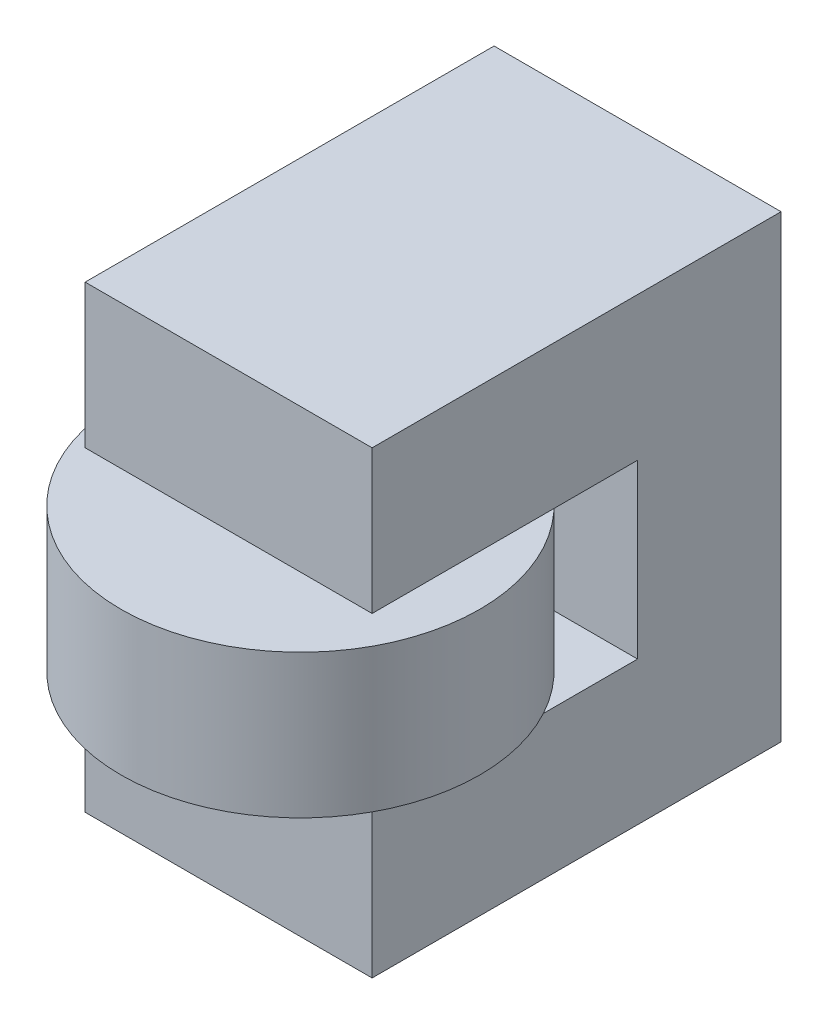
ISO-10303-21;
HEADER;
FILE_DESCRIPTION(('STEP AP214'),'2;1');
FILE_NAME('part.step','',(''),(''),'','','');
FILE_SCHEMA(('AUTOMOTIVE_DESIGN { 1 0 10303 214 1 1 1 1 }'));
ENDSEC;
DATA;
#1=APPLICATION_CONTEXT('core data for automotive mechanical design processes');
#2=APPLICATION_PROTOCOL_DEFINITION('international standard','automotive_design',2000,#1);
#3=PRODUCT_CONTEXT('',#1,'mechanical');
#4=PRODUCT('Part','Part','',(#3));
#5=PRODUCT_RELATED_PRODUCT_CATEGORY('part','',(#4));
#6=PRODUCT_DEFINITION_FORMATION('','',#4);
#7=PRODUCT_DEFINITION_CONTEXT('part definition',#1,'design');
#8=PRODUCT_DEFINITION('design','',#6,#7);
#9=PRODUCT_DEFINITION_SHAPE('','',#8);
#10=(LENGTH_UNIT() NAMED_UNIT(*) SI_UNIT(.MILLI.,.METRE.));
#11=(NAMED_UNIT(*) PLANE_ANGLE_UNIT() SI_UNIT($,.RADIAN.));
#12=(NAMED_UNIT(*) SI_UNIT($,.STERADIAN.) SOLID_ANGLE_UNIT());
#13=UNCERTAINTY_MEASURE_WITH_UNIT(LENGTH_MEASURE(1.E-05),#10,'distance_accuracy_value','');
#14=(GEOMETRIC_REPRESENTATION_CONTEXT(3) GLOBAL_UNCERTAINTY_ASSIGNED_CONTEXT((#13)) GLOBAL_UNIT_ASSIGNED_CONTEXT((#10,
#11,#12)) REPRESENTATION_CONTEXT('',''));
#15=CARTESIAN_POINT('',(0.,0.,0.));
#16=DIRECTION('',(0.,0.,1.));
#17=DIRECTION('',(1.,0.,0.));
#18=AXIS2_PLACEMENT_3D('',#15,#16,#17);
#19=CARTESIAN_POINT('',(-10.,-11.,5.));
#20=DIRECTION('',(0.,0.,1.));
#21=DIRECTION('',(0.,-1.,0.));
#22=AXIS2_PLACEMENT_3D('',#19,#20,#21);
#23=PLANE('',#22);
#24=DIRECTION('',(1.,0.,0.));
#25=VECTOR('',#24,1.);
#26=CARTESIAN_POINT('',(-10.,-11.,5.));
#27=LINE('',#26,#25);
#28=CARTESIAN_POINT('',(-10.,-11.,5.));
#29=VERTEX_POINT('',#28);
#30=CARTESIAN_POINT('',(10.,-11.,5.));
#31=VERTEX_POINT('',#30);
#32=EDGE_CURVE('E49',#29,#31,#27,.T.);
#33=ORIENTED_EDGE('',*,*,#32,.T.);
#34=DIRECTION('',(0.,-1.,0.));
#35=VECTOR('',#34,1.);
#36=CARTESIAN_POINT('',(10.,-11.,5.));
#37=LINE('',#36,#35);
#38=CARTESIAN_POINT('',(10.,-1.,5.));
#39=VERTEX_POINT('',#38);
#40=EDGE_CURVE('E112',#39,#31,#37,.T.);
#41=ORIENTED_EDGE('',*,*,#40,.F.);
#42=DIRECTION('',(1.,0.,0.));
#43=VECTOR('',#42,1.);
#44=CARTESIAN_POINT('',(-10.,-1.,5.));
#45=LINE('',#44,#43);
#46=CARTESIAN_POINT('',(-10.,-1.,5.));
#47=VERTEX_POINT('',#46);
#48=EDGE_CURVE('E12',#47,#39,#45,.T.);
#49=ORIENTED_EDGE('',*,*,#48,.F.);
#50=DIRECTION('',(0.,-1.,0.));
#51=VECTOR('',#50,1.);
#52=CARTESIAN_POINT('',(-10.,-11.,5.));
#53=LINE('',#52,#51);
#54=EDGE_CURVE('E115',#47,#29,#53,.T.);
#55=ORIENTED_EDGE('',*,*,#54,.T.);
#56=EDGE_LOOP('',(#33,#41,#49,#55));
#57=FACE_BOUND('',#56,.T.);
#58=ADVANCED_FACE('F50',(#57),#23,.T.);
#59=CARTESIAN_POINT('',(-10.,-1.,5.));
#60=DIRECTION('',(0.,1.,0.));
#61=DIRECTION('',(0.,0.,1.));
#62=AXIS2_PLACEMENT_3D('',#59,#60,#61);
#63=PLANE('',#62);
#64=ORIENTED_EDGE('',*,*,#48,.T.);
#65=DIRECTION('',(0.,0.,1.));
#66=VECTOR('',#65,1.);
#67=CARTESIAN_POINT('',(10.,-1.,5.));
#68=LINE('',#67,#66);
#69=CARTESIAN_POINT('',(10.,-1.,-13.5));
#70=VERTEX_POINT('',#69);
#71=EDGE_CURVE('E129',#70,#39,#68,.T.);
#72=ORIENTED_EDGE('',*,*,#71,.F.);
#73=DIRECTION('',(1.,0.,0.));
#74=VECTOR('',#73,1.);
#75=CARTESIAN_POINT('',(-10.,-1.,-13.5));
#76=LINE('',#75,#74);
#77=CARTESIAN_POINT('',(-10.,-1.,-13.5));
#78=VERTEX_POINT('',#77);
#79=EDGE_CURVE('E54',#78,#70,#76,.T.);
#80=ORIENTED_EDGE('',*,*,#79,.F.);
#81=DIRECTION('',(0.,0.,1.));
#82=VECTOR('',#81,1.);
#83=CARTESIAN_POINT('',(-10.,-1.,5.));
#84=LINE('',#83,#82);
#85=EDGE_CURVE('E120',#78,#47,#84,.T.);
#86=ORIENTED_EDGE('',*,*,#85,.T.);
#87=EDGE_LOOP('',(#64,#72,#80,#86));
#88=FACE_BOUND('',#87,.T.);
#89=ADVANCED_FACE('F195',(#88),#63,.T.);
#90=CARTESIAN_POINT('',(-10.,-1.,-13.5));
#91=DIRECTION('',(0.,0.,1.));
#92=DIRECTION('',(1.,0.,0.));
#93=AXIS2_PLACEMENT_3D('',#90,#91,#92);
#94=PLANE('',#93);
#95=ORIENTED_EDGE('',*,*,#79,.T.);
#96=DIRECTION('',(0.,-1.,0.));
#97=VECTOR('',#96,1.);
#98=CARTESIAN_POINT('',(10.,-1.,-13.5));
#99=LINE('',#98,#97);
#100=CARTESIAN_POINT('',(10.,11.,-13.5));
#101=VERTEX_POINT('',#100);
#102=EDGE_CURVE('E142',#101,#70,#99,.T.);
#103=ORIENTED_EDGE('',*,*,#102,.F.);
#104=DIRECTION('',(1.,0.,0.));
#105=VECTOR('',#104,1.);
#106=CARTESIAN_POINT('',(-10.,11.,-13.5));
#107=LINE('',#106,#105);
#108=CARTESIAN_POINT('',(-10.,11.,-13.5));
#109=VERTEX_POINT('',#108);
#110=EDGE_CURVE('E163',#109,#101,#107,.T.);
#111=ORIENTED_EDGE('',*,*,#110,.F.);
#112=DIRECTION('',(0.,-1.,0.));
#113=VECTOR('',#112,1.);
#114=CARTESIAN_POINT('',(-10.,-1.,-13.5));
#115=LINE('',#114,#113);
#116=EDGE_CURVE('E159',#109,#78,#115,.T.);
#117=ORIENTED_EDGE('',*,*,#116,.T.);
#118=EDGE_LOOP('',(#95,#103,#111,#117));
#119=FACE_BOUND('',#118,.T.);
#120=ADVANCED_FACE('F194',(#119),#94,.T.);
#121=CARTESIAN_POINT('',(-10.,11.,5.));
#122=DIRECTION('',(0.,-1.,0.));
#123=DIRECTION('',(0.,0.,-1.));
#124=AXIS2_PLACEMENT_3D('',#121,#122,#123);
#125=PLANE('',#124);
#126=ORIENTED_EDGE('',*,*,#110,.T.);
#127=DIRECTION('',(0.,0.,-1.));
#128=VECTOR('',#127,1.);
#129=CARTESIAN_POINT('',(10.,11.,5.));
#130=LINE('',#129,#128);
#131=CARTESIAN_POINT('',(10.,11.,5.));
#132=VERTEX_POINT('',#131);
#133=EDGE_CURVE('E136',#132,#101,#130,.T.);
#134=ORIENTED_EDGE('',*,*,#133,.F.);
#135=DIRECTION('',(1.,0.,0.));
#136=VECTOR('',#135,1.);
#137=CARTESIAN_POINT('',(-10.,11.,5.));
#138=LINE('',#137,#136);
#139=CARTESIAN_POINT('',(-10.,11.,5.));
#140=VERTEX_POINT('',#139);
#141=EDGE_CURVE('E167',#140,#132,#138,.T.);
#142=ORIENTED_EDGE('',*,*,#141,.F.);
#143=DIRECTION('',(0.,0.,-1.));
#144=VECTOR('',#143,1.);
#145=CARTESIAN_POINT('',(-10.,11.,5.));
#146=LINE('',#145,#144);
#147=EDGE_CURVE('E160',#140,#109,#146,.T.);
#148=ORIENTED_EDGE('',*,*,#147,.T.);
#149=EDGE_LOOP('',(#126,#134,#142,#148));
#150=FACE_BOUND('',#149,.T.);
#151=ADVANCED_FACE('F189',(#150),#125,.T.);
#152=CARTESIAN_POINT('',(-10.,21.,5.));
#153=DIRECTION('',(0.,0.,1.));
#154=DIRECTION('',(0.,-1.,0.));
#155=AXIS2_PLACEMENT_3D('',#152,#153,#154);
#156=PLANE('',#155);
#157=ORIENTED_EDGE('',*,*,#141,.T.);
#158=DIRECTION('',(0.,-1.,0.));
#159=VECTOR('',#158,1.);
#160=CARTESIAN_POINT('',(10.,21.,5.));
#161=LINE('',#160,#159);
#162=CARTESIAN_POINT('',(10.,21.,5.));
#163=VERTEX_POINT('',#162);
#164=EDGE_CURVE('E137',#163,#132,#161,.T.);
#165=ORIENTED_EDGE('',*,*,#164,.F.);
#166=DIRECTION('',(1.,0.,0.));
#167=VECTOR('',#166,1.);
#168=CARTESIAN_POINT('',(-10.,21.,5.));
#169=LINE('',#168,#167);
#170=CARTESIAN_POINT('',(-10.,21.,5.));
#171=VERTEX_POINT('',#170);
#172=EDGE_CURVE('E169',#171,#163,#169,.T.);
#173=ORIENTED_EDGE('',*,*,#172,.F.);
#174=DIRECTION('',(0.,-1.,0.));
#175=VECTOR('',#174,1.);
#176=CARTESIAN_POINT('',(-10.,21.,5.));
#177=LINE('',#176,#175);
#178=EDGE_CURVE('E152',#171,#140,#177,.T.);
#179=ORIENTED_EDGE('',*,*,#178,.T.);
#180=EDGE_LOOP('',(#157,#165,#173,#179));
#181=FACE_BOUND('',#180,.T.);
#182=ADVANCED_FACE('F182',(#181),#156,.T.);
#183=CARTESIAN_POINT('',(-10.,21.,-23.5));
#184=DIRECTION('',(0.,1.,0.));
#185=DIRECTION('',(0.,0.,1.));
#186=AXIS2_PLACEMENT_3D('',#183,#184,#185);
#187=PLANE('',#186);
#188=ORIENTED_EDGE('',*,*,#172,.T.);
#189=DIRECTION('',(0.,0.,1.));
#190=VECTOR('',#189,1.);
#191=CARTESIAN_POINT('',(10.,21.,-23.5));
#192=LINE('',#191,#190);
#193=CARTESIAN_POINT('',(10.,21.,-23.5));
#194=VERTEX_POINT('',#193);
#195=EDGE_CURVE('E134',#194,#163,#192,.T.);
#196=ORIENTED_EDGE('',*,*,#195,.F.);
#197=DIRECTION('',(1.,0.,0.));
#198=VECTOR('',#197,1.);
#199=CARTESIAN_POINT('',(-10.,21.,-23.5));
#200=LINE('',#199,#198);
#201=CARTESIAN_POINT('',(-10.,21.,-23.5));
#202=VERTEX_POINT('',#201);
#203=EDGE_CURVE('E168',#202,#194,#200,.T.);
#204=ORIENTED_EDGE('',*,*,#203,.F.);
#205=DIRECTION('',(0.,0.,1.));
#206=VECTOR('',#205,1.);
#207=CARTESIAN_POINT('',(-10.,21.,-23.5));
#208=LINE('',#207,#206);
#209=EDGE_CURVE('E151',#202,#171,#208,.T.);
#210=ORIENTED_EDGE('',*,*,#209,.T.);
#211=EDGE_LOOP('',(#188,#196,#204,#210));
#212=FACE_BOUND('',#211,.T.);
#213=ADVANCED_FACE('F180',(#212),#187,.T.);
#214=CARTESIAN_POINT('',(-10.,21.,-23.5));
#215=DIRECTION('',(0.,0.,-1.));
#216=DIRECTION('',(-1.,0.,0.));
#217=AXIS2_PLACEMENT_3D('',#214,#215,#216);
#218=PLANE('',#217);
#219=ORIENTED_EDGE('',*,*,#203,.T.);
#220=DIRECTION('',(0.,1.,0.));
#221=VECTOR('',#220,1.);
#222=CARTESIAN_POINT('',(10.,21.,-23.5));
#223=LINE('',#222,#221);
#224=CARTESIAN_POINT('',(10.,-11.,-23.5));
#225=VERTEX_POINT('',#224);
#226=EDGE_CURVE('E121',#225,#194,#223,.T.);
#227=ORIENTED_EDGE('',*,*,#226,.F.);
#228=DIRECTION('',(1.,0.,0.));
#229=VECTOR('',#228,1.);
#230=CARTESIAN_POINT('',(-10.,-11.,-23.5));
#231=LINE('',#230,#229);
#232=CARTESIAN_POINT('',(-10.,-11.,-23.5));
#233=VERTEX_POINT('',#232);
#234=EDGE_CURVE('E117',#233,#225,#231,.T.);
#235=ORIENTED_EDGE('',*,*,#234,.F.);
#236=DIRECTION('',(0.,1.,0.));
#237=VECTOR('',#236,1.);
#238=CARTESIAN_POINT('',(-10.,21.,-23.5));
#239=LINE('',#238,#237);
#240=EDGE_CURVE('E146',#233,#202,#239,.T.);
#241=ORIENTED_EDGE('',*,*,#240,.T.);
#242=EDGE_LOOP('',(#219,#227,#235,#241));
#243=FACE_BOUND('',#242,.T.);
#244=ADVANCED_FACE('F175',(#243),#218,.T.);
#245=CARTESIAN_POINT('',(-10.,-11.,-23.5));
#246=DIRECTION('',(0.,-1.,0.));
#247=DIRECTION('',(0.,0.,-1.));
#248=AXIS2_PLACEMENT_3D('',#245,#246,#247);
#249=PLANE('',#248);
#250=ORIENTED_EDGE('',*,*,#234,.T.);
#251=DIRECTION('',(0.,0.,-1.));
#252=VECTOR('',#251,1.);
#253=CARTESIAN_POINT('',(10.,-11.,-23.5));
#254=LINE('',#253,#252);
#255=EDGE_CURVE('E116',#31,#225,#254,.T.);
#256=ORIENTED_EDGE('',*,*,#255,.F.);
#257=ORIENTED_EDGE('',*,*,#32,.F.);
#258=DIRECTION('',(0.,0.,-1.));
#259=VECTOR('',#258,1.);
#260=CARTESIAN_POINT('',(-10.,-11.,-23.5));
#261=LINE('',#260,#259);
#262=EDGE_CURVE('E148',#29,#233,#261,.T.);
#263=ORIENTED_EDGE('',*,*,#262,.T.);
#264=EDGE_LOOP('',(#250,#256,#257,#263));
#265=FACE_BOUND('',#264,.T.);
#266=ADVANCED_FACE('F118',(#265),#249,.T.);
#267=CARTESIAN_POINT('',(-10.,0.,0.));
#268=DIRECTION('',(-1.,0.,0.));
#269=DIRECTION('',(0.,0.,1.));
#270=AXIS2_PLACEMENT_3D('',#267,#268,#269);
#271=PLANE('',#270);
#272=ORIENTED_EDGE('',*,*,#54,.F.);
#273=ORIENTED_EDGE('',*,*,#85,.F.);
#274=ORIENTED_EDGE('',*,*,#116,.F.);
#275=ORIENTED_EDGE('',*,*,#147,.F.);
#276=ORIENTED_EDGE('',*,*,#178,.F.);
#277=ORIENTED_EDGE('',*,*,#209,.F.);
#278=ORIENTED_EDGE('',*,*,#240,.F.);
#279=ORIENTED_EDGE('',*,*,#262,.F.);
#280=EDGE_LOOP('',(#272,#273,#274,#275,#276,#277,#278,#279));
#281=FACE_BOUND('',#280,.T.);
#282=ADVANCED_FACE('F184',(#281),#271,.T.);
#283=CARTESIAN_POINT('',(10.,0.,0.));
#284=DIRECTION('',(-1.,0.,0.));
#285=DIRECTION('',(0.,0.,1.));
#286=AXIS2_PLACEMENT_3D('',#283,#284,#285);
#287=PLANE('',#286);
#288=ORIENTED_EDGE('',*,*,#40,.T.);
#289=ORIENTED_EDGE('',*,*,#255,.T.);
#290=ORIENTED_EDGE('',*,*,#226,.T.);
#291=ORIENTED_EDGE('',*,*,#195,.T.);
#292=ORIENTED_EDGE('',*,*,#164,.T.);
#293=ORIENTED_EDGE('',*,*,#133,.T.);
#294=ORIENTED_EDGE('',*,*,#102,.T.);
#295=ORIENTED_EDGE('',*,*,#71,.T.);
#296=EDGE_LOOP('',(#288,#289,#290,#291,#292,#293,#294,#295));
#297=FACE_BOUND('',#296,.T.);
#298=ADVANCED_FACE('F130',(#297),#287,.F.);
#299=CLOSED_SHELL('',(#58,#89,#120,#151,#182,#213,#244,#266,#282,#298));
#300=MANIFOLD_SOLID_BREP('B2',#299);
#301=CARTESIAN_POINT('',(0.,10.,0.));
#302=DIRECTION('',(0.,-1.,0.));
#303=DIRECTION('',(0.,0.,-1.));
#304=AXIS2_PLACEMENT_3D('',#301,#302,#303);
#305=CYLINDRICAL_SURFACE('',#304,12.5);
#306=CARTESIAN_POINT('',(0.,10.,0.));
#307=DIRECTION('',(0.,1.,0.));
#308=DIRECTION('',(0.,0.,1.));
#309=AXIS2_PLACEMENT_3D('',#306,#307,#308);
#310=CIRCLE('',#309,12.5);
#311=CARTESIAN_POINT('',(0.,10.,12.5));
#312=VERTEX_POINT('',#311);
#313=EDGE_CURVE('E46',#312,#312,#310,.T.);
#314=ORIENTED_EDGE('',*,*,#313,.F.);
#315=EDGE_LOOP('',(#314));
#316=FACE_BOUND('',#315,.T.);
#317=CARTESIAN_POINT('',(0.,0.,0.));
#318=DIRECTION('',(0.,1.,0.));
#319=DIRECTION('',(0.,0.,1.));
#320=AXIS2_PLACEMENT_3D('',#317,#318,#319);
#321=CIRCLE('',#320,12.5);
#322=CARTESIAN_POINT('',(0.,0.,12.5));
#323=VERTEX_POINT('',#322);
#324=EDGE_CURVE('E279',#323,#323,#321,.T.);
#325=ORIENTED_EDGE('',*,*,#324,.T.);
#326=EDGE_LOOP('',(#325));
#327=FACE_BOUND('',#326,.T.);
#328=ADVANCED_FACE('F274',(#316,#327),#305,.T.);
#329=CARTESIAN_POINT('',(0.,10.,0.));
#330=DIRECTION('',(0.,1.,0.));
#331=DIRECTION('',(0.,0.,1.));
#332=AXIS2_PLACEMENT_3D('',#329,#330,#331);
#333=PLANE('',#332);
#334=CARTESIAN_POINT('',(0.,10.,0.));
#335=DIRECTION('',(0.,-1.,0.));
#336=DIRECTION('',(0.,0.,-1.));
#337=AXIS2_PLACEMENT_3D('',#334,#335,#336);
#338=CIRCLE('',#337,2.45745);
#339=CARTESIAN_POINT('',(0.,10.,-2.45745));
#340=VERTEX_POINT('',#339);
#341=EDGE_CURVE('E283',#340,#340,#338,.T.);
#342=ORIENTED_EDGE('',*,*,#341,.T.);
#343=EDGE_LOOP('',(#342));
#344=FACE_BOUND('',#343,.T.);
#345=ORIENTED_EDGE('',*,*,#313,.T.);
#346=EDGE_LOOP('',(#345));
#347=FACE_BOUND('',#346,.T.);
#348=ADVANCED_FACE('F299',(#344,#347),#333,.T.);
#349=CARTESIAN_POINT('',(0.,0.,0.));
#350=DIRECTION('',(0.,1.,0.));
#351=DIRECTION('',(0.,0.,1.));
#352=AXIS2_PLACEMENT_3D('',#349,#350,#351);
#353=PLANE('',#352);
#354=CARTESIAN_POINT('',(0.,0.,0.));
#355=DIRECTION('',(0.,-1.,0.));
#356=DIRECTION('',(0.,0.,-1.));
#357=AXIS2_PLACEMENT_3D('',#354,#355,#356);
#358=CIRCLE('',#357,2.45745);
#359=CARTESIAN_POINT('',(0.,0.,-2.45745));
#360=VERTEX_POINT('',#359);
#361=EDGE_CURVE('E286',#360,#360,#358,.T.);
#362=ORIENTED_EDGE('',*,*,#361,.F.);
#363=EDGE_LOOP('',(#362));
#364=FACE_BOUND('',#363,.T.);
#365=ORIENTED_EDGE('',*,*,#324,.F.);
#366=EDGE_LOOP('',(#365));
#367=FACE_BOUND('',#366,.T.);
#368=ADVANCED_FACE('F293',(#364,#367),#353,.F.);
#369=CARTESIAN_POINT('',(0.,0.,0.));
#370=DIRECTION('',(0.,-1.,0.));
#371=DIRECTION('',(0.,0.,-1.));
#372=AXIS2_PLACEMENT_3D('',#369,#370,#371);
#373=CYLINDRICAL_SURFACE('',#372,2.45745);
#374=ORIENTED_EDGE('',*,*,#341,.F.);
#375=EDGE_LOOP('',(#374));
#376=FACE_BOUND('',#375,.T.);
#377=ORIENTED_EDGE('',*,*,#361,.T.);
#378=EDGE_LOOP('',(#377));
#379=FACE_BOUND('',#378,.T.);
#380=ADVANCED_FACE('F291',(#376,#379),#373,.F.);
#381=CLOSED_SHELL('',(#328,#348,#368,#380));
#382=MANIFOLD_SOLID_BREP('B6',#381);
#383=ADVANCED_BREP_SHAPE_REPRESENTATION('',(#18,#300,#382),#14);
#384=SHAPE_DEFINITION_REPRESENTATION(#9,#383);
ENDSEC;
END-ISO-10303-21;
